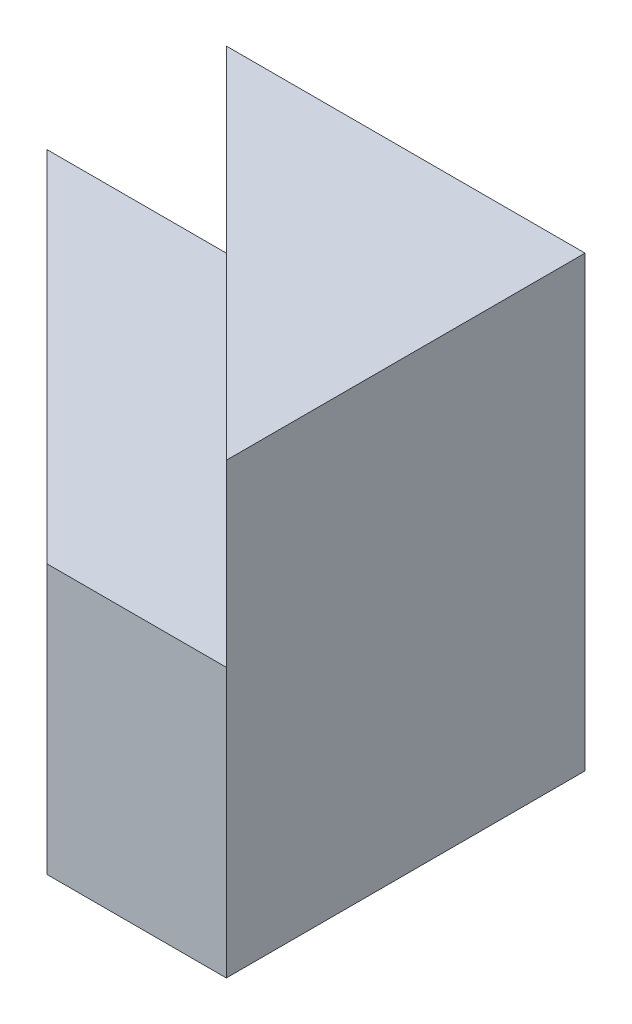
ISO-10303-21;
HEADER;
FILE_DESCRIPTION(('STEP AP214'),'2;1');
FILE_NAME('part.step','',(''),(''),'','','');
FILE_SCHEMA(('AUTOMOTIVE_DESIGN { 1 0 10303 214 1 1 1 1 }'));
ENDSEC;
DATA;
#1=APPLICATION_CONTEXT('core data for automotive mechanical design processes');
#2=APPLICATION_PROTOCOL_DEFINITION('international standard','automotive_design',2000,#1);
#3=PRODUCT_CONTEXT('',#1,'mechanical');
#4=PRODUCT('Part','Part','',(#3));
#5=PRODUCT_RELATED_PRODUCT_CATEGORY('part','',(#4));
#6=PRODUCT_DEFINITION_FORMATION('','',#4);
#7=PRODUCT_DEFINITION_CONTEXT('part definition',#1,'design');
#8=PRODUCT_DEFINITION('design','',#6,#7);
#9=PRODUCT_DEFINITION_SHAPE('','',#8);
#10=(LENGTH_UNIT() NAMED_UNIT(*) SI_UNIT(.MILLI.,.METRE.));
#11=(NAMED_UNIT(*) PLANE_ANGLE_UNIT() SI_UNIT($,.RADIAN.));
#12=(NAMED_UNIT(*) SI_UNIT($,.STERADIAN.) SOLID_ANGLE_UNIT());
#13=UNCERTAINTY_MEASURE_WITH_UNIT(LENGTH_MEASURE(1.E-05),#10,'distance_accuracy_value','');
#14=(GEOMETRIC_REPRESENTATION_CONTEXT(3) GLOBAL_UNCERTAINTY_ASSIGNED_CONTEXT((#13)) GLOBAL_UNIT_ASSIGNED_CONTEXT((#10,
#11,#12)) REPRESENTATION_CONTEXT('',''));
#15=CARTESIAN_POINT('',(0.,0.,0.));
#16=DIRECTION('',(0.,0.,1.));
#17=DIRECTION('',(1.,0.,0.));
#18=AXIS2_PLACEMENT_3D('',#15,#16,#17);
#19=CARTESIAN_POINT('',(0.,3.,0.));
#20=DIRECTION('',(0.,-1.,0.));
#21=DIRECTION('',(0.,0.,-1.));
#22=AXIS2_PLACEMENT_3D('',#19,#20,#21);
#23=PLANE('',#22);
#24=DIRECTION('',(-1.,0.,0.));
#25=VECTOR('',#24,1.);
#26=CARTESIAN_POINT('',(0.,3.,-4.));
#27=LINE('',#26,#25);
#28=CARTESIAN_POINT('',(2.,3.,-4.));
#29=VERTEX_POINT('',#28);
#30=CARTESIAN_POINT('',(0.,3.,-4.));
#31=VERTEX_POINT('',#30);
#32=EDGE_CURVE('E91',#29,#31,#27,.T.);
#33=ORIENTED_EDGE('',*,*,#32,.T.);
#34=DIRECTION('',(-0.707106781186548,0.,-0.707106781186548));
#35=VECTOR('',#34,1.);
#36=CARTESIAN_POINT('',(4.,3.,0.));
#37=LINE('',#36,#35);
#38=CARTESIAN_POINT('',(4.,3.,0.));
#39=VERTEX_POINT('',#38);
#40=EDGE_CURVE('E84',#39,#31,#37,.T.);
#41=ORIENTED_EDGE('',*,*,#40,.F.);
#42=DIRECTION('',(1.,0.,0.));
#43=VECTOR('',#42,1.);
#44=CARTESIAN_POINT('',(0.,3.,0.));
#45=LINE('',#44,#43);
#46=CARTESIAN_POINT('',(6.,3.,0.));
#47=VERTEX_POINT('',#46);
#48=EDGE_CURVE('E89',#39,#47,#45,.T.);
#49=ORIENTED_EDGE('',*,*,#48,.T.);
#50=DIRECTION('',(0.707106781186548,0.,0.707106781186548));
#51=VECTOR('',#50,1.);
#52=CARTESIAN_POINT('',(6.,3.,0.));
#53=LINE('',#52,#51);
#54=EDGE_CURVE('E48',#29,#47,#53,.T.);
#55=ORIENTED_EDGE('',*,*,#54,.F.);
#56=EDGE_LOOP('',(#33,#41,#49,#55));
#57=FACE_BOUND('',#56,.T.);
#58=ADVANCED_FACE('F33',(#57),#23,.F.);
#59=CARTESIAN_POINT('',(0.,3.,0.));
#60=DIRECTION('',(0.,0.,-1.));
#61=DIRECTION('',(-1.,0.,0.));
#62=AXIS2_PLACEMENT_3D('',#59,#60,#61);
#63=PLANE('',#62);
#64=ORIENTED_EDGE('',*,*,#48,.F.);
#65=DIRECTION('',(0.,1.,0.));
#66=VECTOR('',#65,1.);
#67=CARTESIAN_POINT('',(4.,-7.,0.));
#68=LINE('',#67,#66);
#69=CARTESIAN_POINT('',(4.,0.,0.));
#70=VERTEX_POINT('',#69);
#71=EDGE_CURVE('E81',#70,#39,#68,.T.);
#72=ORIENTED_EDGE('',*,*,#71,.F.);
#73=DIRECTION('',(1.,0.,0.));
#74=VECTOR('',#73,1.);
#75=CARTESIAN_POINT('',(0.,0.,0.));
#76=LINE('',#75,#74);
#77=CARTESIAN_POINT('',(6.,0.,0.));
#78=VERTEX_POINT('',#77);
#79=EDGE_CURVE('E106',#70,#78,#76,.T.);
#80=ORIENTED_EDGE('',*,*,#79,.T.);
#81=DIRECTION('',(0.,-1.,0.));
#82=VECTOR('',#81,1.);
#83=CARTESIAN_POINT('',(6.,3.,0.));
#84=LINE('',#83,#82);
#85=EDGE_CURVE('E41',#47,#78,#84,.T.);
#86=ORIENTED_EDGE('',*,*,#85,.F.);
#87=EDGE_LOOP('',(#64,#72,#80,#86));
#88=FACE_BOUND('',#87,.T.);
#89=ADVANCED_FACE('F35',(#88),#63,.F.);
#90=CARTESIAN_POINT('',(6.,3.,0.));
#91=DIRECTION('',(-1.,0.,0.));
#92=DIRECTION('',(0.,0.,1.));
#93=AXIS2_PLACEMENT_3D('',#90,#91,#92);
#94=PLANE('',#93);
#95=DIRECTION('',(0.,0.,-1.));
#96=VECTOR('',#95,1.);
#97=CARTESIAN_POINT('',(6.,0.,0.));
#98=LINE('',#97,#96);
#99=CARTESIAN_POINT('',(6.,0.,-4.));
#100=VERTEX_POINT('',#99);
#101=EDGE_CURVE('E98',#78,#100,#98,.T.);
#102=ORIENTED_EDGE('',*,*,#101,.T.);
#103=DIRECTION('',(0.,-1.,0.));
#104=VECTOR('',#103,1.);
#105=CARTESIAN_POINT('',(6.,3.,-4.));
#106=LINE('',#105,#104);
#107=CARTESIAN_POINT('',(6.,5.,-4.));
#108=VERTEX_POINT('',#107);
#109=EDGE_CURVE('E137',#108,#100,#106,.T.);
#110=ORIENTED_EDGE('',*,*,#109,.F.);
#111=DIRECTION('',(0.,0.,-1.));
#112=VECTOR('',#111,1.);
#113=CARTESIAN_POINT('',(6.,5.,-4.));
#114=LINE('',#113,#112);
#115=CARTESIAN_POINT('',(6.,5.,0.));
#116=VERTEX_POINT('',#115);
#117=EDGE_CURVE('E121',#116,#108,#114,.T.);
#118=ORIENTED_EDGE('',*,*,#117,.F.);
#119=DIRECTION('',(0.,-1.,0.));
#120=VECTOR('',#119,1.);
#121=CARTESIAN_POINT('',(6.,5.,0.));
#122=LINE('',#121,#120);
#123=EDGE_CURVE('E102',#116,#47,#122,.T.);
#124=ORIENTED_EDGE('',*,*,#123,.T.);
#125=ORIENTED_EDGE('',*,*,#85,.T.);
#126=EDGE_LOOP('',(#102,#110,#118,#124,#125));
#127=FACE_BOUND('',#126,.T.);
#128=ADVANCED_FACE('F140',(#127),#94,.F.);
#129=CARTESIAN_POINT('',(0.,3.,-4.));
#130=DIRECTION('',(0.,0.,1.));
#131=DIRECTION('',(1.,0.,0.));
#132=AXIS2_PLACEMENT_3D('',#129,#130,#131);
#133=PLANE('',#132);
#134=DIRECTION('',(-1.,0.,0.));
#135=VECTOR('',#134,1.);
#136=CARTESIAN_POINT('',(0.,0.,-4.));
#137=LINE('',#136,#135);
#138=CARTESIAN_POINT('',(0.,0.,-4.));
#139=VERTEX_POINT('',#138);
#140=EDGE_CURVE('E94',#100,#139,#137,.T.);
#141=ORIENTED_EDGE('',*,*,#140,.T.);
#142=DIRECTION('',(0.,-1.,0.));
#143=VECTOR('',#142,1.);
#144=CARTESIAN_POINT('',(0.,3.,-4.));
#145=LINE('',#144,#143);
#146=EDGE_CURVE('E55',#31,#139,#145,.T.);
#147=ORIENTED_EDGE('',*,*,#146,.F.);
#148=ORIENTED_EDGE('',*,*,#32,.F.);
#149=DIRECTION('',(0.,-1.,0.));
#150=VECTOR('',#149,1.);
#151=CARTESIAN_POINT('',(2.,5.,-4.));
#152=LINE('',#151,#150);
#153=CARTESIAN_POINT('',(2.,5.,-4.));
#154=VERTEX_POINT('',#153);
#155=EDGE_CURVE('E115',#154,#29,#152,.T.);
#156=ORIENTED_EDGE('',*,*,#155,.F.);
#157=DIRECTION('',(-1.,0.,0.));
#158=VECTOR('',#157,1.);
#159=CARTESIAN_POINT('',(2.,5.,-4.));
#160=LINE('',#159,#158);
#161=EDGE_CURVE('E112',#108,#154,#160,.T.);
#162=ORIENTED_EDGE('',*,*,#161,.F.);
#163=ORIENTED_EDGE('',*,*,#109,.T.);
#164=EDGE_LOOP('',(#141,#147,#148,#156,#162,#163));
#165=FACE_BOUND('',#164,.T.);
#166=ADVANCED_FACE('F135',(#165),#133,.F.);
#167=CARTESIAN_POINT('',(0.,0.,0.));
#168=DIRECTION('',(0.,-1.,0.));
#169=DIRECTION('',(0.,0.,-1.));
#170=AXIS2_PLACEMENT_3D('',#167,#168,#169);
#171=PLANE('',#170);
#172=DIRECTION('',(0.707106781186548,0.,0.707106781186548));
#173=VECTOR('',#172,1.);
#174=CARTESIAN_POINT('',(2.,0.,-2.));
#175=LINE('',#174,#173);
#176=EDGE_CURVE('E11',#139,#70,#175,.T.);
#177=ORIENTED_EDGE('',*,*,#176,.F.);
#178=ORIENTED_EDGE('',*,*,#140,.F.);
#179=ORIENTED_EDGE('',*,*,#101,.F.);
#180=ORIENTED_EDGE('',*,*,#79,.F.);
#181=EDGE_LOOP('',(#177,#178,#179,#180));
#182=FACE_BOUND('',#181,.T.);
#183=ADVANCED_FACE('F142',(#182),#171,.T.);
#184=CARTESIAN_POINT('',(6.,5.,0.));
#185=DIRECTION('',(0.707106781186547,0.,-0.707106781186547));
#186=DIRECTION('',(-0.707106781186548,0.,-0.707106781186548));
#187=AXIS2_PLACEMENT_3D('',#184,#185,#186);
#188=PLANE('',#187);
#189=ORIENTED_EDGE('',*,*,#54,.T.);
#190=ORIENTED_EDGE('',*,*,#123,.F.);
#191=DIRECTION('',(0.707106781186548,0.,0.707106781186548));
#192=VECTOR('',#191,1.);
#193=CARTESIAN_POINT('',(6.,5.,0.));
#194=LINE('',#193,#192);
#195=EDGE_CURVE('E126',#154,#116,#194,.T.);
#196=ORIENTED_EDGE('',*,*,#195,.F.);
#197=ORIENTED_EDGE('',*,*,#155,.T.);
#198=EDGE_LOOP('',(#189,#190,#196,#197));
#199=FACE_BOUND('',#198,.T.);
#200=ADVANCED_FACE('F144',(#199),#188,.F.);
#201=CARTESIAN_POINT('',(0.,5.,0.));
#202=DIRECTION('',(0.,-1.,0.));
#203=DIRECTION('',(0.,0.,-1.));
#204=AXIS2_PLACEMENT_3D('',#201,#202,#203);
#205=PLANE('',#204);
#206=ORIENTED_EDGE('',*,*,#161,.T.);
#207=ORIENTED_EDGE('',*,*,#195,.T.);
#208=ORIENTED_EDGE('',*,*,#117,.T.);
#209=EDGE_LOOP('',(#206,#207,#208));
#210=FACE_BOUND('',#209,.T.);
#211=ADVANCED_FACE('F132',(#210),#205,.F.);
#212=CARTESIAN_POINT('',(4.,-7.,0.));
#213=DIRECTION('',(0.707106781186548,0.,-0.707106781186548));
#214=DIRECTION('',(-0.707106781186548,0.,-0.707106781186548));
#215=AXIS2_PLACEMENT_3D('',#212,#213,#214);
#216=PLANE('',#215);
#217=ORIENTED_EDGE('',*,*,#176,.T.);
#218=ORIENTED_EDGE('',*,*,#71,.T.);
#219=ORIENTED_EDGE('',*,*,#40,.T.);
#220=ORIENTED_EDGE('',*,*,#146,.T.);
#221=EDGE_LOOP('',(#217,#218,#219,#220));
#222=FACE_BOUND('',#221,.T.);
#223=ADVANCED_FACE('F83',(#222),#216,.F.);
#224=CLOSED_SHELL('',(#58,#89,#128,#166,#183,#200,#211,#223));
#225=MANIFOLD_SOLID_BREP('B2',#224);
#226=ADVANCED_BREP_SHAPE_REPRESENTATION('',(#18,#225),#14);
#227=SHAPE_DEFINITION_REPRESENTATION(#9,#226);
ENDSEC;
END-ISO-10303-21;
